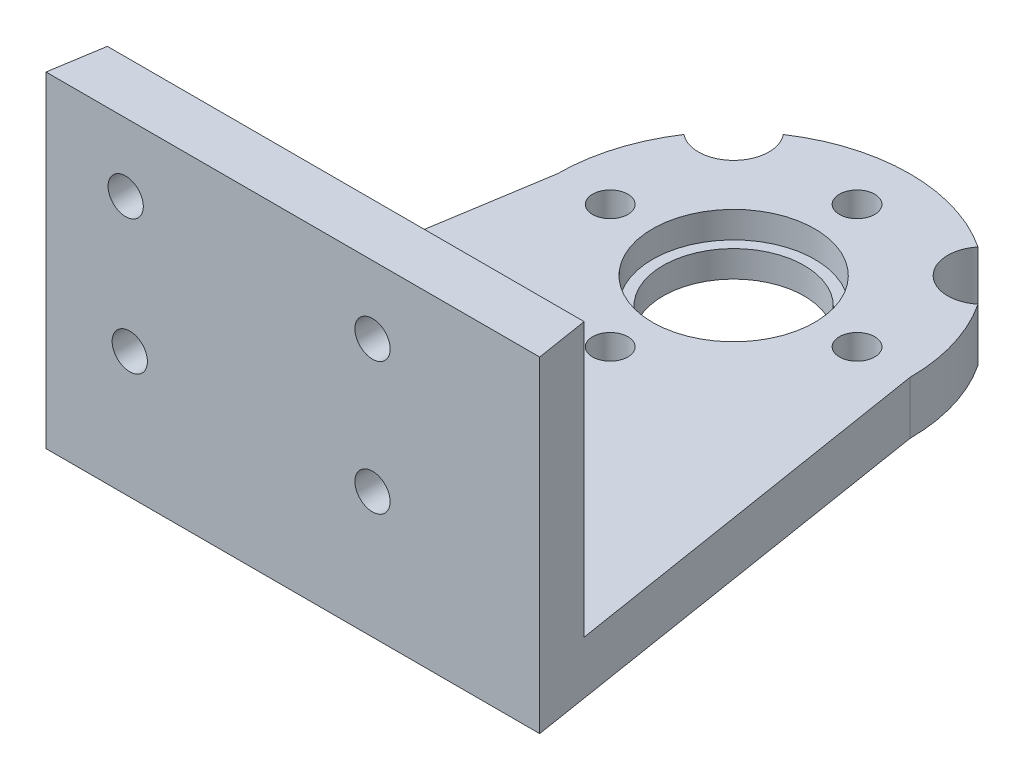
ISO-10303-21;
HEADER;
FILE_DESCRIPTION(('STEP AP214'),'2;1');
FILE_NAME('part.step','',(''),(''),'','','');
FILE_SCHEMA(('AUTOMOTIVE_DESIGN { 1 0 10303 214 1 1 1 1 }'));
ENDSEC;
DATA;
#1=APPLICATION_CONTEXT('core data for automotive mechanical design processes');
#2=APPLICATION_PROTOCOL_DEFINITION('international standard','automotive_design',2000,#1);
#3=PRODUCT_CONTEXT('',#1,'mechanical');
#4=PRODUCT('Part','Part','',(#3));
#5=PRODUCT_RELATED_PRODUCT_CATEGORY('part','',(#4));
#6=PRODUCT_DEFINITION_FORMATION('','',#4);
#7=PRODUCT_DEFINITION_CONTEXT('part definition',#1,'design');
#8=PRODUCT_DEFINITION('design','',#6,#7);
#9=PRODUCT_DEFINITION_SHAPE('','',#8);
#10=(LENGTH_UNIT() NAMED_UNIT(*) SI_UNIT(.MILLI.,.METRE.));
#11=(NAMED_UNIT(*) PLANE_ANGLE_UNIT() SI_UNIT($,.RADIAN.));
#12=(NAMED_UNIT(*) SI_UNIT($,.STERADIAN.) SOLID_ANGLE_UNIT());
#13=UNCERTAINTY_MEASURE_WITH_UNIT(LENGTH_MEASURE(1.E-05),#10,'distance_accuracy_value','');
#14=(GEOMETRIC_REPRESENTATION_CONTEXT(3) GLOBAL_UNCERTAINTY_ASSIGNED_CONTEXT((#13)) GLOBAL_UNIT_ASSIGNED_CONTEXT((#10,
#11,#12)) REPRESENTATION_CONTEXT('',''));
#15=CARTESIAN_POINT('',(0.,0.,0.));
#16=DIRECTION('',(0.,0.,1.));
#17=DIRECTION('',(1.,0.,0.));
#18=AXIS2_PLACEMENT_3D('',#15,#16,#17);
#19=CARTESIAN_POINT('',(-4.6552,1.5,-4.6552));
#20=DIRECTION('',(0.,1.,0.));
#21=DIRECTION('',(0.,0.,1.));
#22=AXIS2_PLACEMENT_3D('',#19,#20,#21);
#23=PLANE('',#22);
#24=CARTESIAN_POINT('',(0.,1.5,0.));
#25=DIRECTION('',(0.,1.,0.));
#26=DIRECTION('',(0.,0.,1.));
#27=AXIS2_PLACEMENT_3D('',#24,#25,#26);
#28=CIRCLE('',#27,4.);
#29=CARTESIAN_POINT('',(0.,1.5,4.));
#30=VERTEX_POINT('',#29);
#31=EDGE_CURVE('E21',#30,#30,#28,.T.);
#32=ORIENTED_EDGE('',*,*,#31,.F.);
#33=EDGE_LOOP('',(#32));
#34=FACE_BOUND('',#33,.T.);
#35=CARTESIAN_POINT('',(0.,1.5,0.));
#36=DIRECTION('',(0.,1.,0.));
#37=DIRECTION('',(0.,0.,1.));
#38=AXIS2_PLACEMENT_3D('',#35,#36,#37);
#39=CIRCLE('',#38,4.6);
#40=CARTESIAN_POINT('',(0.,1.5,4.6));
#41=VERTEX_POINT('',#40);
#42=EDGE_CURVE('E247',#41,#41,#39,.F.);
#43=ORIENTED_EDGE('',*,*,#42,.F.);
#44=EDGE_LOOP('',(#43));
#45=FACE_BOUND('',#44,.T.);
#46=ADVANCED_FACE('F17',(#34,#45),#23,.T.);
#47=CARTESIAN_POINT('',(0.,0.,0.));
#48=DIRECTION('',(0.,1.,0.));
#49=DIRECTION('',(0.,0.,1.));
#50=AXIS2_PLACEMENT_3D('',#47,#48,#49);
#51=CYLINDRICAL_SURFACE('',#50,4.);
#52=CARTESIAN_POINT('',(0.,0.,0.));
#53=DIRECTION('',(0.,1.,0.));
#54=DIRECTION('',(0.,0.,1.));
#55=AXIS2_PLACEMENT_3D('',#52,#53,#54);
#56=CIRCLE('',#55,4.);
#57=CARTESIAN_POINT('',(0.,0.,4.));
#58=VERTEX_POINT('',#57);
#59=EDGE_CURVE('E212',#58,#58,#56,.T.);
#60=ORIENTED_EDGE('',*,*,#59,.F.);
#61=EDGE_LOOP('',(#60));
#62=FACE_BOUND('',#61,.T.);
#63=ORIENTED_EDGE('',*,*,#31,.T.);
#64=EDGE_LOOP('',(#63));
#65=FACE_BOUND('',#64,.T.);
#66=ADVANCED_FACE('F520',(#62,#65),#51,.F.);
#67=CARTESIAN_POINT('',(0.,3.,0.));
#68=DIRECTION('',(0.,-1.,0.));
#69=DIRECTION('',(0.,0.,-1.));
#70=AXIS2_PLACEMENT_3D('',#67,#68,#69);
#71=CYLINDRICAL_SURFACE('',#70,10.);
#72=DIRECTION('',(0.,-1.,0.));
#73=VECTOR('',#72,1.);
#74=CARTESIAN_POINT('',(-8.33677118611014,1.5,-5.5225217238544));
#75=LINE('',#74,#73);
#76=CARTESIAN_POINT('',(-8.33677118483739,0.,-5.52252172577574));
#77=VERTEX_POINT('',#76);
#78=CARTESIAN_POINT('',(-8.33677118483739,3.,-5.52252172577574));
#79=VERTEX_POINT('',#78);
#80=EDGE_CURVE('E261',#77,#79,#75,.F.);
#81=ORIENTED_EDGE('',*,*,#80,.F.);
#82=CARTESIAN_POINT('',(0.,0.,0.));
#83=DIRECTION('',(0.,-1.,0.));
#84=DIRECTION('',(0.,0.,-1.));
#85=AXIS2_PLACEMENT_3D('',#82,#83,#84);
#86=CIRCLE('',#85,10.);
#87=CARTESIAN_POINT('',(-10.,0.,0.));
#88=VERTEX_POINT('',#87);
#89=EDGE_CURVE('E243',#88,#77,#86,.T.);
#90=ORIENTED_EDGE('',*,*,#89,.F.);
#91=DIRECTION('',(0.,1.,0.));
#92=VECTOR('',#91,1.);
#93=CARTESIAN_POINT('',(-10.,9.25,0.));
#94=LINE('',#93,#92);
#95=CARTESIAN_POINT('',(-10.,3.,0.));
#96=VERTEX_POINT('',#95);
#97=EDGE_CURVE('E115',#88,#96,#94,.T.);
#98=ORIENTED_EDGE('',*,*,#97,.T.);
#99=CARTESIAN_POINT('',(0.,3.,0.));
#100=DIRECTION('',(0.,-1.,0.));
#101=DIRECTION('',(0.,0.,-1.));
#102=AXIS2_PLACEMENT_3D('',#99,#100,#101);
#103=CIRCLE('',#102,10.);
#104=EDGE_CURVE('E204',#96,#79,#103,.T.);
#105=ORIENTED_EDGE('',*,*,#104,.T.);
#106=EDGE_LOOP('',(#81,#90,#98,#105));
#107=FACE_BOUND('',#106,.T.);
#108=ADVANCED_FACE('F278',(#107),#71,.T.);
#109=CARTESIAN_POINT('',(-7.071067812,0.,-7.071067812));
#110=DIRECTION('',(0.,1.,0.));
#111=DIRECTION('',(0.,0.,1.));
#112=AXIS2_PLACEMENT_3D('',#109,#110,#111);
#113=CYLINDRICAL_SURFACE('',#112,2.);
#114=CARTESIAN_POINT('',(-7.071067812,3.,-7.071067812));
#115=DIRECTION('',(0.,1.,0.));
#116=DIRECTION('',(0.,0.,1.));
#117=AXIS2_PLACEMENT_3D('',#114,#115,#116);
#118=CIRCLE('',#117,2.);
#119=CARTESIAN_POINT('',(-5.52252172812786,3.,-8.33677118327927));
#120=VERTEX_POINT('',#119);
#121=EDGE_CURVE('E84',#79,#120,#118,.T.);
#122=ORIENTED_EDGE('',*,*,#121,.T.);
#123=DIRECTION('',(0.,1.,0.));
#124=VECTOR('',#123,1.);
#125=CARTESIAN_POINT('',(-5.52252172855865,1.5,-8.3367711829939));
#126=LINE('',#125,#124);
#127=CARTESIAN_POINT('',(-5.52252172812786,0.,-8.33677118327927));
#128=VERTEX_POINT('',#127);
#129=EDGE_CURVE('E256',#120,#128,#126,.F.);
#130=ORIENTED_EDGE('',*,*,#129,.T.);
#131=CARTESIAN_POINT('',(-7.071067812,0.,-7.071067812));
#132=DIRECTION('',(0.,1.,0.));
#133=DIRECTION('',(0.,0.,1.));
#134=AXIS2_PLACEMENT_3D('',#131,#132,#133);
#135=CIRCLE('',#134,2.);
#136=EDGE_CURVE('E240',#77,#128,#135,.T.);
#137=ORIENTED_EDGE('',*,*,#136,.F.);
#138=ORIENTED_EDGE('',*,*,#80,.T.);
#139=EDGE_LOOP('',(#122,#130,#137,#138));
#140=FACE_BOUND('',#139,.T.);
#141=ADVANCED_FACE('F281',(#140),#113,.F.);
#142=CARTESIAN_POINT('',(0.,3.,0.));
#143=DIRECTION('',(0.,-1.,0.));
#144=DIRECTION('',(0.,0.,-1.));
#145=AXIS2_PLACEMENT_3D('',#142,#143,#144);
#146=CYLINDRICAL_SURFACE('',#145,10.);
#147=CARTESIAN_POINT('',(0.,3.,0.));
#148=DIRECTION('',(0.,-1.,0.));
#149=DIRECTION('',(0.,0.,-1.));
#150=AXIS2_PLACEMENT_3D('',#147,#148,#149);
#151=CIRCLE('',#150,10.);
#152=CARTESIAN_POINT('',(5.52252172785054,3.,-8.33677118375239));
#153=VERTEX_POINT('',#152);
#154=EDGE_CURVE('E88',#120,#153,#151,.T.);
#155=ORIENTED_EDGE('',*,*,#154,.T.);
#156=DIRECTION('',(0.,-1.,0.));
#157=VECTOR('',#156,1.);
#158=CARTESIAN_POINT('',(5.522521728004,1.5,-8.33677118394015));
#159=LINE('',#158,#157);
#160=CARTESIAN_POINT('',(5.52252172785054,0.,-8.33677118375239));
#161=VERTEX_POINT('',#160);
#162=EDGE_CURVE('E94',#161,#153,#159,.F.);
#163=ORIENTED_EDGE('',*,*,#162,.F.);
#164=CARTESIAN_POINT('',(0.,0.,0.));
#165=DIRECTION('',(0.,-1.,0.));
#166=DIRECTION('',(0.,0.,-1.));
#167=AXIS2_PLACEMENT_3D('',#164,#165,#166);
#168=CIRCLE('',#167,10.);
#169=EDGE_CURVE('E238',#128,#161,#168,.T.);
#170=ORIENTED_EDGE('',*,*,#169,.F.);
#171=ORIENTED_EDGE('',*,*,#129,.F.);
#172=EDGE_LOOP('',(#155,#163,#170,#171));
#173=FACE_BOUND('',#172,.T.);
#174=ADVANCED_FACE('F283',(#173),#146,.T.);
#175=CARTESIAN_POINT('',(7.071067812,0.,-7.071067812));
#176=DIRECTION('',(0.,1.,0.));
#177=DIRECTION('',(0.,0.,1.));
#178=AXIS2_PLACEMENT_3D('',#175,#176,#177);
#179=CYLINDRICAL_SURFACE('',#178,2.);
#180=ORIENTED_EDGE('',*,*,#162,.T.);
#181=CARTESIAN_POINT('',(7.071067812,3.,-7.071067812));
#182=DIRECTION('',(0.,1.,0.));
#183=DIRECTION('',(0.,0.,1.));
#184=AXIS2_PLACEMENT_3D('',#181,#182,#183);
#185=CIRCLE('',#184,2.);
#186=CARTESIAN_POINT('',(8.3367711843415,3.,-5.52252172652433));
#187=VERTEX_POINT('',#186);
#188=EDGE_CURVE('E200',#153,#187,#185,.T.);
#189=ORIENTED_EDGE('',*,*,#188,.T.);
#190=DIRECTION('',(0.,1.,0.));
#191=VECTOR('',#190,1.);
#192=CARTESIAN_POINT('',(8.33677118511837,1.5,-5.52252172535157));
#193=LINE('',#192,#191);
#194=CARTESIAN_POINT('',(8.3367711843415,0.,-5.52252172652433));
#195=VERTEX_POINT('',#194);
#196=EDGE_CURVE('E249',#187,#195,#193,.F.);
#197=ORIENTED_EDGE('',*,*,#196,.T.);
#198=CARTESIAN_POINT('',(7.071067812,0.,-7.071067812));
#199=DIRECTION('',(0.,1.,0.));
#200=DIRECTION('',(0.,0.,1.));
#201=AXIS2_PLACEMENT_3D('',#198,#199,#200);
#202=CIRCLE('',#201,2.);
#203=EDGE_CURVE('E236',#161,#195,#202,.T.);
#204=ORIENTED_EDGE('',*,*,#203,.F.);
#205=EDGE_LOOP('',(#180,#189,#197,#204));
#206=FACE_BOUND('',#205,.T.);
#207=ADVANCED_FACE('F284',(#206),#179,.F.);
#208=CARTESIAN_POINT('',(0.,3.,0.));
#209=DIRECTION('',(0.,-1.,0.));
#210=DIRECTION('',(0.,0.,-1.));
#211=AXIS2_PLACEMENT_3D('',#208,#209,#210);
#212=CYLINDRICAL_SURFACE('',#211,10.);
#213=ORIENTED_EDGE('',*,*,#196,.F.);
#214=CARTESIAN_POINT('',(0.,3.,0.));
#215=DIRECTION('',(0.,-1.,0.));
#216=DIRECTION('',(0.,0.,-1.));
#217=AXIS2_PLACEMENT_3D('',#214,#215,#216);
#218=CIRCLE('',#217,10.);
#219=CARTESIAN_POINT('',(10.,3.,0.));
#220=VERTEX_POINT('',#219);
#221=EDGE_CURVE('E197',#187,#220,#218,.T.);
#222=ORIENTED_EDGE('',*,*,#221,.T.);
#223=DIRECTION('',(0.,-1.,0.));
#224=VECTOR('',#223,1.);
#225=CARTESIAN_POINT('',(10.,9.25,0.));
#226=LINE('',#225,#224);
#227=CARTESIAN_POINT('',(10.,0.,0.));
#228=VERTEX_POINT('',#227);
#229=EDGE_CURVE('E148',#220,#228,#226,.T.);
#230=ORIENTED_EDGE('',*,*,#229,.T.);
#231=CARTESIAN_POINT('',(0.,0.,0.));
#232=DIRECTION('',(0.,-1.,0.));
#233=DIRECTION('',(0.,0.,-1.));
#234=AXIS2_PLACEMENT_3D('',#231,#232,#233);
#235=CIRCLE('',#234,10.);
#236=EDGE_CURVE('E246',#195,#228,#235,.T.);
#237=ORIENTED_EDGE('',*,*,#236,.F.);
#238=EDGE_LOOP('',(#213,#222,#230,#237));
#239=FACE_BOUND('',#238,.T.);
#240=ADVANCED_FACE('F286',(#239),#212,.T.);
#241=CARTESIAN_POINT('',(0.,1.5,0.));
#242=DIRECTION('',(0.,1.,0.));
#243=DIRECTION('',(0.,0.,1.));
#244=AXIS2_PLACEMENT_3D('',#241,#242,#243);
#245=CYLINDRICAL_SURFACE('',#244,4.6);
#246=ORIENTED_EDGE('',*,*,#42,.T.);
#247=EDGE_LOOP('',(#246));
#248=FACE_BOUND('',#247,.T.);
#249=CARTESIAN_POINT('',(0.,3.,0.));
#250=DIRECTION('',(0.,1.,0.));
#251=DIRECTION('',(0.,0.,1.));
#252=AXIS2_PLACEMENT_3D('',#249,#250,#251);
#253=CIRCLE('',#252,4.6);
#254=CARTESIAN_POINT('',(0.,3.,4.6));
#255=VERTEX_POINT('',#254);
#256=EDGE_CURVE('E194',#255,#255,#253,.T.);
#257=ORIENTED_EDGE('',*,*,#256,.T.);
#258=EDGE_LOOP('',(#257));
#259=FACE_BOUND('',#258,.T.);
#260=ADVANCED_FACE('F293',(#248,#259),#245,.F.);
#261=CARTESIAN_POINT('',(-6.52,0.,19.));
#262=DIRECTION('',(0.,1.,0.));
#263=DIRECTION('',(0.,0.,1.));
#264=AXIS2_PLACEMENT_3D('',#261,#262,#263);
#265=CYLINDRICAL_SURFACE('',#264,1.);
#266=CARTESIAN_POINT('',(-6.52,0.,19.));
#267=DIRECTION('',(0.,1.,0.));
#268=DIRECTION('',(0.,0.,1.));
#269=AXIS2_PLACEMENT_3D('',#266,#267,#268);
#270=CIRCLE('',#269,1.);
#271=CARTESIAN_POINT('',(-6.52,0.,20.));
#272=VERTEX_POINT('',#271);
#273=EDGE_CURVE('E215',#272,#272,#270,.T.);
#274=ORIENTED_EDGE('',*,*,#273,.F.);
#275=EDGE_LOOP('',(#274));
#276=FACE_BOUND('',#275,.T.);
#277=CARTESIAN_POINT('',(-6.52,3.,19.));
#278=DIRECTION('',(0.,1.,0.));
#279=DIRECTION('',(0.,0.,1.));
#280=AXIS2_PLACEMENT_3D('',#277,#278,#279);
#281=CIRCLE('',#280,1.);
#282=CARTESIAN_POINT('',(-6.52,3.,20.));
#283=VERTEX_POINT('',#282);
#284=EDGE_CURVE('E191',#283,#283,#281,.T.);
#285=ORIENTED_EDGE('',*,*,#284,.T.);
#286=EDGE_LOOP('',(#285));
#287=FACE_BOUND('',#286,.T.);
#288=ADVANCED_FACE('F343',(#276,#287),#265,.F.);
#289=CARTESIAN_POINT('',(6.52,0.,19.));
#290=DIRECTION('',(0.,1.,0.));
#291=DIRECTION('',(0.,0.,1.));
#292=AXIS2_PLACEMENT_3D('',#289,#290,#291);
#293=CYLINDRICAL_SURFACE('',#292,1.);
#294=CARTESIAN_POINT('',(6.52,0.,19.));
#295=DIRECTION('',(0.,1.,0.));
#296=DIRECTION('',(0.,0.,1.));
#297=AXIS2_PLACEMENT_3D('',#294,#295,#296);
#298=CIRCLE('',#297,1.);
#299=CARTESIAN_POINT('',(6.52,0.,20.));
#300=VERTEX_POINT('',#299);
#301=EDGE_CURVE('E218',#300,#300,#298,.T.);
#302=ORIENTED_EDGE('',*,*,#301,.F.);
#303=EDGE_LOOP('',(#302));
#304=FACE_BOUND('',#303,.T.);
#305=CARTESIAN_POINT('',(6.52,3.,19.));
#306=DIRECTION('',(0.,1.,0.));
#307=DIRECTION('',(0.,0.,1.));
#308=AXIS2_PLACEMENT_3D('',#305,#306,#307);
#309=CIRCLE('',#308,1.);
#310=CARTESIAN_POINT('',(6.52,3.,20.));
#311=VERTEX_POINT('',#310);
#312=EDGE_CURVE('E188',#311,#311,#309,.T.);
#313=ORIENTED_EDGE('',*,*,#312,.T.);
#314=EDGE_LOOP('',(#313));
#315=FACE_BOUND('',#314,.T.);
#316=ADVANCED_FACE('F339',(#304,#315),#293,.F.);
#317=CARTESIAN_POINT('',(0.,0.,19.));
#318=DIRECTION('',(0.,1.,0.));
#319=DIRECTION('',(0.,0.,1.));
#320=AXIS2_PLACEMENT_3D('',#317,#318,#319);
#321=CYLINDRICAL_SURFACE('',#320,1.);
#322=CARTESIAN_POINT('',(0.,0.,19.));
#323=DIRECTION('',(0.,1.,0.));
#324=DIRECTION('',(0.,0.,1.));
#325=AXIS2_PLACEMENT_3D('',#322,#323,#324);
#326=CIRCLE('',#325,1.);
#327=CARTESIAN_POINT('',(0.,0.,20.));
#328=VERTEX_POINT('',#327);
#329=EDGE_CURVE('E221',#328,#328,#326,.T.);
#330=ORIENTED_EDGE('',*,*,#329,.F.);
#331=EDGE_LOOP('',(#330));
#332=FACE_BOUND('',#331,.T.);
#333=CARTESIAN_POINT('',(0.,3.,19.));
#334=DIRECTION('',(0.,1.,0.));
#335=DIRECTION('',(0.,0.,1.));
#336=AXIS2_PLACEMENT_3D('',#333,#334,#335);
#337=CIRCLE('',#336,1.);
#338=CARTESIAN_POINT('',(0.,3.,20.));
#339=VERTEX_POINT('',#338);
#340=EDGE_CURVE('E185',#339,#339,#337,.T.);
#341=ORIENTED_EDGE('',*,*,#340,.T.);
#342=EDGE_LOOP('',(#341));
#343=FACE_BOUND('',#342,.T.);
#344=ADVANCED_FACE('F335',(#332,#343),#321,.F.);
#345=CARTESIAN_POINT('',(0.,0.,7.));
#346=DIRECTION('',(0.,1.,0.));
#347=DIRECTION('',(0.,0.,1.));
#348=AXIS2_PLACEMENT_3D('',#345,#346,#347);
#349=CYLINDRICAL_SURFACE('',#348,1.);
#350=CARTESIAN_POINT('',(0.,0.,7.));
#351=DIRECTION('',(0.,1.,0.));
#352=DIRECTION('',(0.,0.,1.));
#353=AXIS2_PLACEMENT_3D('',#350,#351,#352);
#354=CIRCLE('',#353,1.);
#355=CARTESIAN_POINT('',(0.,0.,8.));
#356=VERTEX_POINT('',#355);
#357=EDGE_CURVE('E224',#356,#356,#354,.T.);
#358=ORIENTED_EDGE('',*,*,#357,.F.);
#359=EDGE_LOOP('',(#358));
#360=FACE_BOUND('',#359,.T.);
#361=CARTESIAN_POINT('',(0.,3.,7.));
#362=DIRECTION('',(0.,1.,0.));
#363=DIRECTION('',(0.,0.,1.));
#364=AXIS2_PLACEMENT_3D('',#361,#362,#363);
#365=CIRCLE('',#364,1.);
#366=CARTESIAN_POINT('',(0.,3.,8.));
#367=VERTEX_POINT('',#366);
#368=EDGE_CURVE('E182',#367,#367,#365,.T.);
#369=ORIENTED_EDGE('',*,*,#368,.T.);
#370=EDGE_LOOP('',(#369));
#371=FACE_BOUND('',#370,.T.);
#372=ADVANCED_FACE('F331',(#360,#371),#349,.F.);
#373=CARTESIAN_POINT('',(-7.,0.,0.));
#374=DIRECTION('',(0.,1.,0.));
#375=DIRECTION('',(0.,0.,1.));
#376=AXIS2_PLACEMENT_3D('',#373,#374,#375);
#377=CYLINDRICAL_SURFACE('',#376,1.);
#378=CARTESIAN_POINT('',(-7.,0.,0.));
#379=DIRECTION('',(0.,1.,0.));
#380=DIRECTION('',(0.,0.,1.));
#381=AXIS2_PLACEMENT_3D('',#378,#379,#380);
#382=CIRCLE('',#381,1.);
#383=CARTESIAN_POINT('',(-7.,0.,1.));
#384=VERTEX_POINT('',#383);
#385=EDGE_CURVE('E227',#384,#384,#382,.T.);
#386=ORIENTED_EDGE('',*,*,#385,.F.);
#387=EDGE_LOOP('',(#386));
#388=FACE_BOUND('',#387,.T.);
#389=CARTESIAN_POINT('',(-7.,3.,0.));
#390=DIRECTION('',(0.,1.,0.));
#391=DIRECTION('',(0.,0.,1.));
#392=AXIS2_PLACEMENT_3D('',#389,#390,#391);
#393=CIRCLE('',#392,1.);
#394=CARTESIAN_POINT('',(-7.,3.,1.));
#395=VERTEX_POINT('',#394);
#396=EDGE_CURVE('E179',#395,#395,#393,.T.);
#397=ORIENTED_EDGE('',*,*,#396,.T.);
#398=EDGE_LOOP('',(#397));
#399=FACE_BOUND('',#398,.T.);
#400=ADVANCED_FACE('F327',(#388,#399),#377,.F.);
#401=CARTESIAN_POINT('',(0.,0.,-7.));
#402=DIRECTION('',(0.,1.,0.));
#403=DIRECTION('',(0.,0.,1.));
#404=AXIS2_PLACEMENT_3D('',#401,#402,#403);
#405=CYLINDRICAL_SURFACE('',#404,1.);
#406=CARTESIAN_POINT('',(0.,0.,-7.));
#407=DIRECTION('',(0.,1.,0.));
#408=DIRECTION('',(0.,0.,1.));
#409=AXIS2_PLACEMENT_3D('',#406,#407,#408);
#410=CIRCLE('',#409,1.);
#411=CARTESIAN_POINT('',(0.,0.,-6.));
#412=VERTEX_POINT('',#411);
#413=EDGE_CURVE('E230',#412,#412,#410,.T.);
#414=ORIENTED_EDGE('',*,*,#413,.F.);
#415=EDGE_LOOP('',(#414));
#416=FACE_BOUND('',#415,.T.);
#417=CARTESIAN_POINT('',(0.,3.,-7.));
#418=DIRECTION('',(0.,1.,0.));
#419=DIRECTION('',(0.,0.,1.));
#420=AXIS2_PLACEMENT_3D('',#417,#418,#419);
#421=CIRCLE('',#420,1.);
#422=CARTESIAN_POINT('',(0.,3.,-6.));
#423=VERTEX_POINT('',#422);
#424=EDGE_CURVE('E132',#423,#423,#421,.T.);
#425=ORIENTED_EDGE('',*,*,#424,.T.);
#426=EDGE_LOOP('',(#425));
#427=FACE_BOUND('',#426,.T.);
#428=ADVANCED_FACE('F323',(#416,#427),#405,.F.);
#429=CARTESIAN_POINT('',(7.,0.,0.));
#430=DIRECTION('',(0.,1.,0.));
#431=DIRECTION('',(0.,0.,1.));
#432=AXIS2_PLACEMENT_3D('',#429,#430,#431);
#433=CYLINDRICAL_SURFACE('',#432,1.);
#434=CARTESIAN_POINT('',(7.,0.,0.));
#435=DIRECTION('',(0.,1.,0.));
#436=DIRECTION('',(0.,0.,1.));
#437=AXIS2_PLACEMENT_3D('',#434,#435,#436);
#438=CIRCLE('',#437,1.);
#439=CARTESIAN_POINT('',(7.,0.,1.));
#440=VERTEX_POINT('',#439);
#441=EDGE_CURVE('E233',#440,#440,#438,.T.);
#442=ORIENTED_EDGE('',*,*,#441,.F.);
#443=EDGE_LOOP('',(#442));
#444=FACE_BOUND('',#443,.T.);
#445=CARTESIAN_POINT('',(7.,3.,0.));
#446=DIRECTION('',(0.,1.,0.));
#447=DIRECTION('',(0.,0.,1.));
#448=AXIS2_PLACEMENT_3D('',#445,#446,#447);
#449=CIRCLE('',#448,1.);
#450=CARTESIAN_POINT('',(7.,3.,1.));
#451=VERTEX_POINT('',#450);
#452=EDGE_CURVE('E129',#451,#451,#449,.T.);
#453=ORIENTED_EDGE('',*,*,#452,.T.);
#454=EDGE_LOOP('',(#453));
#455=FACE_BOUND('',#454,.T.);
#456=ADVANCED_FACE('F320',(#444,#455),#433,.F.);
#457=CARTESIAN_POINT('',(-14.168,0.,25.));
#458=DIRECTION('',(0.,-1.,0.));
#459=DIRECTION('',(0.,0.,-1.));
#460=AXIS2_PLACEMENT_3D('',#457,#458,#459);
#461=PLANE('',#460);
#462=ORIENTED_EDGE('',*,*,#59,.T.);
#463=EDGE_LOOP('',(#462));
#464=FACE_BOUND('',#463,.T.);
#465=ORIENTED_EDGE('',*,*,#273,.T.);
#466=EDGE_LOOP('',(#465));
#467=FACE_BOUND('',#466,.T.);
#468=ORIENTED_EDGE('',*,*,#301,.T.);
#469=EDGE_LOOP('',(#468));
#470=FACE_BOUND('',#469,.T.);
#471=ORIENTED_EDGE('',*,*,#329,.T.);
#472=EDGE_LOOP('',(#471));
#473=FACE_BOUND('',#472,.T.);
#474=ORIENTED_EDGE('',*,*,#357,.T.);
#475=EDGE_LOOP('',(#474));
#476=FACE_BOUND('',#475,.T.);
#477=ORIENTED_EDGE('',*,*,#385,.T.);
#478=EDGE_LOOP('',(#477));
#479=FACE_BOUND('',#478,.T.);
#480=ORIENTED_EDGE('',*,*,#413,.T.);
#481=EDGE_LOOP('',(#480));
#482=FACE_BOUND('',#481,.T.);
#483=ORIENTED_EDGE('',*,*,#441,.T.);
#484=EDGE_LOOP('',(#483));
#485=FACE_BOUND('',#484,.T.);
#486=ORIENTED_EDGE('',*,*,#169,.T.);
#487=ORIENTED_EDGE('',*,*,#203,.T.);
#488=ORIENTED_EDGE('',*,*,#236,.T.);
#489=DIRECTION('',(0.157990501106673,0.,0.987440631916705));
#490=VECTOR('',#489,1.);
#491=CARTESIAN_POINT('',(12.,0.,12.5));
#492=LINE('',#491,#490);
#493=CARTESIAN_POINT('',(13.9999999991103,0.,24.9999999998646));
#494=VERTEX_POINT('',#493);
#495=EDGE_CURVE('E145',#228,#494,#492,.T.);
#496=ORIENTED_EDGE('',*,*,#495,.T.);
#497=DIRECTION('',(-1.,0.,0.));
#498=VECTOR('',#497,1.);
#499=CARTESIAN_POINT('',(0.,0.,25.));
#500=LINE('',#499,#498);
#501=CARTESIAN_POINT('',(-13.9999999999567,0.,24.9999999997292));
#502=VERTEX_POINT('',#501);
#503=EDGE_CURVE('E140',#494,#502,#500,.T.);
#504=ORIENTED_EDGE('',*,*,#503,.T.);
#505=DIRECTION('',(0.157990501106673,0.,-0.987440631916705));
#506=VECTOR('',#505,1.);
#507=CARTESIAN_POINT('',(-12.,0.,12.5));
#508=LINE('',#507,#506);
#509=EDGE_CURVE('E114',#502,#88,#508,.T.);
#510=ORIENTED_EDGE('',*,*,#509,.T.);
#511=ORIENTED_EDGE('',*,*,#89,.T.);
#512=ORIENTED_EDGE('',*,*,#136,.T.);
#513=EDGE_LOOP('',(#486,#487,#488,#496,#504,#510,#511,#512));
#514=FACE_BOUND('',#513,.T.);
#515=ADVANCED_FACE('F270',(#464,#467,#470,#473,#476,#479,#482,#485,#514),#461,.T.);
#516=CARTESIAN_POINT('',(10.,0.,0.));
#517=DIRECTION('',(-0.987440631916705,0.,0.157990501106673));
#518=DIRECTION('',(0.157990501106673,0.,0.987440631916705));
#519=AXIS2_PLACEMENT_3D('',#516,#517,#518);
#520=PLANE('',#519);
#521=ORIENTED_EDGE('',*,*,#229,.F.);
#522=DIRECTION('',(0.157990501106673,0.,0.987440631916705));
#523=VECTOR('',#522,1.);
#524=CARTESIAN_POINT('',(10.,3.,0.));
#525=LINE('',#524,#523);
#526=CARTESIAN_POINT('',(13.52,3.,22.));
#527=VERTEX_POINT('',#526);
#528=EDGE_CURVE('E208',#220,#527,#525,.T.);
#529=ORIENTED_EDGE('',*,*,#528,.T.);
#530=DIRECTION('',(0.,1.,0.));
#531=VECTOR('',#530,1.);
#532=CARTESIAN_POINT('',(13.52,10.75,22.));
#533=LINE('',#532,#531);
#534=CARTESIAN_POINT('',(13.519999998752,18.5,22.));
#535=VERTEX_POINT('',#534);
#536=EDGE_CURVE('E155',#527,#535,#533,.T.);
#537=ORIENTED_EDGE('',*,*,#536,.T.);
#538=DIRECTION('',(-0.157990499679173,0.,-0.987440632145105));
#539=VECTOR('',#538,1.);
#540=CARTESIAN_POINT('',(13.999999993056,18.5,25.));
#541=LINE('',#540,#539);
#542=CARTESIAN_POINT('',(13.999999996528,18.5,25.));
#543=VERTEX_POINT('',#542);
#544=EDGE_CURVE('E147',#543,#535,#541,.T.);
#545=ORIENTED_EDGE('',*,*,#544,.F.);
#546=DIRECTION('',(0.,-1.,0.));
#547=VECTOR('',#546,1.);
#548=CARTESIAN_POINT('',(14.,9.25,25.));
#549=LINE('',#548,#547);
#550=EDGE_CURVE('E125',#543,#494,#549,.T.);
#551=ORIENTED_EDGE('',*,*,#550,.T.);
#552=ORIENTED_EDGE('',*,*,#495,.F.);
#553=EDGE_LOOP('',(#521,#529,#537,#545,#551,#552));
#554=FACE_BOUND('',#553,.T.);
#555=ADVANCED_FACE('F274',(#554),#520,.F.);
#556=CARTESIAN_POINT('',(-14.168,18.5,22.));
#557=DIRECTION('',(0.,1.,0.));
#558=DIRECTION('',(0.,0.,1.));
#559=AXIS2_PLACEMENT_3D('',#556,#557,#558);
#560=PLANE('',#559);
#561=ORIENTED_EDGE('',*,*,#544,.T.);
#562=DIRECTION('',(-1.,0.,0.));
#563=VECTOR('',#562,1.);
#564=CARTESIAN_POINT('',(0.,18.5,22.));
#565=LINE('',#564,#563);
#566=CARTESIAN_POINT('',(-13.519999998752,18.5,22.));
#567=VERTEX_POINT('',#566);
#568=EDGE_CURVE('E109',#535,#567,#565,.T.);
#569=ORIENTED_EDGE('',*,*,#568,.T.);
#570=DIRECTION('',(-0.157990501106673,0.,0.987440631916705));
#571=VECTOR('',#570,1.);
#572=CARTESIAN_POINT('',(-12.,18.5,12.5));
#573=LINE('',#572,#571);
#574=CARTESIAN_POINT('',(-13.999999998264,18.5,25.));
#575=VERTEX_POINT('',#574);
#576=EDGE_CURVE('E104',#567,#575,#573,.T.);
#577=ORIENTED_EDGE('',*,*,#576,.T.);
#578=DIRECTION('',(1.,0.,0.));
#579=VECTOR('',#578,1.);
#580=CARTESIAN_POINT('',(0.,18.5,25.));
#581=LINE('',#580,#579);
#582=EDGE_CURVE('E107',#575,#543,#581,.T.);
#583=ORIENTED_EDGE('',*,*,#582,.T.);
#584=EDGE_LOOP('',(#561,#569,#577,#583));
#585=FACE_BOUND('',#584,.T.);
#586=ADVANCED_FACE('F106',(#585),#560,.T.);
#587=CARTESIAN_POINT('',(-14.,0.,25.));
#588=DIRECTION('',(0.987440631916705,0.,0.157990501106673));
#589=DIRECTION('',(0.157990501106673,0.,-0.987440631916705));
#590=AXIS2_PLACEMENT_3D('',#587,#588,#589);
#591=PLANE('',#590);
#592=DIRECTION('',(0.,1.,0.));
#593=VECTOR('',#592,1.);
#594=CARTESIAN_POINT('',(-14.,9.25,25.));
#595=LINE('',#594,#593);
#596=EDGE_CURVE('E122',#502,#575,#595,.T.);
#597=ORIENTED_EDGE('',*,*,#596,.T.);
#598=ORIENTED_EDGE('',*,*,#576,.F.);
#599=DIRECTION('',(0.,-1.,0.));
#600=VECTOR('',#599,1.);
#601=CARTESIAN_POINT('',(-13.52,10.75,22.));
#602=LINE('',#601,#600);
#603=CARTESIAN_POINT('',(-13.52,3.,22.));
#604=VERTEX_POINT('',#603);
#605=EDGE_CURVE('E154',#567,#604,#602,.T.);
#606=ORIENTED_EDGE('',*,*,#605,.T.);
#607=DIRECTION('',(0.157990501106673,0.,-0.987440631916705));
#608=VECTOR('',#607,1.);
#609=CARTESIAN_POINT('',(-14.,3.,25.));
#610=LINE('',#609,#608);
#611=EDGE_CURVE('E36',#604,#96,#610,.T.);
#612=ORIENTED_EDGE('',*,*,#611,.T.);
#613=ORIENTED_EDGE('',*,*,#97,.F.);
#614=ORIENTED_EDGE('',*,*,#509,.F.);
#615=EDGE_LOOP('',(#597,#598,#606,#612,#613,#614));
#616=FACE_BOUND('',#615,.T.);
#617=ADVANCED_FACE('F127',(#616),#591,.F.);
#618=CARTESIAN_POINT('',(-13.68224,3.,22.));
#619=DIRECTION('',(0.,-1.,0.));
#620=DIRECTION('',(0.,0.,-1.));
#621=AXIS2_PLACEMENT_3D('',#618,#619,#620);
#622=PLANE('',#621);
#623=ORIENTED_EDGE('',*,*,#452,.F.);
#624=EDGE_LOOP('',(#623));
#625=FACE_BOUND('',#624,.T.);
#626=ORIENTED_EDGE('',*,*,#424,.F.);
#627=EDGE_LOOP('',(#626));
#628=FACE_BOUND('',#627,.T.);
#629=ORIENTED_EDGE('',*,*,#396,.F.);
#630=EDGE_LOOP('',(#629));
#631=FACE_BOUND('',#630,.T.);
#632=ORIENTED_EDGE('',*,*,#368,.F.);
#633=EDGE_LOOP('',(#632));
#634=FACE_BOUND('',#633,.T.);
#635=ORIENTED_EDGE('',*,*,#340,.F.);
#636=EDGE_LOOP('',(#635));
#637=FACE_BOUND('',#636,.T.);
#638=ORIENTED_EDGE('',*,*,#312,.F.);
#639=EDGE_LOOP('',(#638));
#640=FACE_BOUND('',#639,.T.);
#641=ORIENTED_EDGE('',*,*,#284,.F.);
#642=EDGE_LOOP('',(#641));
#643=FACE_BOUND('',#642,.T.);
#644=ORIENTED_EDGE('',*,*,#256,.F.);
#645=EDGE_LOOP('',(#644));
#646=FACE_BOUND('',#645,.T.);
#647=ORIENTED_EDGE('',*,*,#221,.F.);
#648=ORIENTED_EDGE('',*,*,#188,.F.);
#649=ORIENTED_EDGE('',*,*,#154,.F.);
#650=ORIENTED_EDGE('',*,*,#121,.F.);
#651=ORIENTED_EDGE('',*,*,#104,.F.);
#652=ORIENTED_EDGE('',*,*,#611,.F.);
#653=DIRECTION('',(1.,0.,0.));
#654=VECTOR('',#653,1.);
#655=CARTESIAN_POINT('',(0.,3.,22.));
#656=LINE('',#655,#654);
#657=EDGE_CURVE('E168',#604,#527,#656,.T.);
#658=ORIENTED_EDGE('',*,*,#657,.T.);
#659=ORIENTED_EDGE('',*,*,#528,.F.);
#660=EDGE_LOOP('',(#647,#648,#649,#650,#651,#652,#658,#659));
#661=FACE_BOUND('',#660,.T.);
#662=ADVANCED_FACE('F318',(#625,#628,#631,#634,#637,#640,#643,#646,#661),#622,.F.);
#663=CARTESIAN_POINT('',(-9.481224865,14.651837118,25.));
#664=DIRECTION('',(0.,0.,-1.));
#665=DIRECTION('',(-1.,0.,0.));
#666=AXIS2_PLACEMENT_3D('',#663,#664,#665);
#667=CYLINDRICAL_SURFACE('',#666,0.999999999999999);
#668=CARTESIAN_POINT('',(-9.481224865,14.651837118,25.));
#669=DIRECTION('',(0.,0.,-1.));
#670=DIRECTION('',(-1.,0.,0.));
#671=AXIS2_PLACEMENT_3D('',#668,#669,#670);
#672=CIRCLE('',#671,0.999999999999999);
#673=CARTESIAN_POINT('',(-10.481224865,14.651837118,25.));
#674=VERTEX_POINT('',#673);
#675=EDGE_CURVE('E142',#674,#674,#672,.F.);
#676=ORIENTED_EDGE('',*,*,#675,.T.);
#677=EDGE_LOOP('',(#676));
#678=FACE_BOUND('',#677,.T.);
#679=CARTESIAN_POINT('',(-9.481224865,14.651837118,22.));
#680=DIRECTION('',(0.,0.,-1.));
#681=DIRECTION('',(-1.,0.,0.));
#682=AXIS2_PLACEMENT_3D('',#679,#680,#681);
#683=CIRCLE('',#682,0.999999999999999);
#684=CARTESIAN_POINT('',(-10.481224865,14.651837118,22.));
#685=VERTEX_POINT('',#684);
#686=EDGE_CURVE('E165',#685,#685,#683,.T.);
#687=ORIENTED_EDGE('',*,*,#686,.T.);
#688=EDGE_LOOP('',(#687));
#689=FACE_BOUND('',#688,.T.);
#690=ADVANCED_FACE('F314',(#678,#689),#667,.F.);
#691=CARTESIAN_POINT('',(4.518775135,14.651837118,25.));
#692=DIRECTION('',(0.,0.,-1.));
#693=DIRECTION('',(-1.,0.,0.));
#694=AXIS2_PLACEMENT_3D('',#691,#692,#693);
#695=CYLINDRICAL_SURFACE('',#694,1.);
#696=CARTESIAN_POINT('',(4.518775135,14.651837118,25.));
#697=DIRECTION('',(0.,0.,-1.));
#698=DIRECTION('',(-1.,0.,0.));
#699=AXIS2_PLACEMENT_3D('',#696,#697,#698);
#700=CIRCLE('',#699,1.);
#701=CARTESIAN_POINT('',(3.518775135,14.651837118,25.));
#702=VERTEX_POINT('',#701);
#703=EDGE_CURVE('E172',#702,#702,#700,.F.);
#704=ORIENTED_EDGE('',*,*,#703,.T.);
#705=EDGE_LOOP('',(#704));
#706=FACE_BOUND('',#705,.T.);
#707=CARTESIAN_POINT('',(4.518775135,14.651837118,22.));
#708=DIRECTION('',(0.,0.,-1.));
#709=DIRECTION('',(-1.,0.,0.));
#710=AXIS2_PLACEMENT_3D('',#707,#708,#709);
#711=CIRCLE('',#710,1.);
#712=CARTESIAN_POINT('',(3.518775135,14.651837118,22.));
#713=VERTEX_POINT('',#712);
#714=EDGE_CURVE('E162',#713,#713,#711,.T.);
#715=ORIENTED_EDGE('',*,*,#714,.T.);
#716=EDGE_LOOP('',(#715));
#717=FACE_BOUND('',#716,.T.);
#718=ADVANCED_FACE('F310',(#706,#717),#695,.F.);
#719=CARTESIAN_POINT('',(4.518775135,7.151837118,25.));
#720=DIRECTION('',(0.,0.,-1.));
#721=DIRECTION('',(-1.,0.,0.));
#722=AXIS2_PLACEMENT_3D('',#719,#720,#721);
#723=CYLINDRICAL_SURFACE('',#722,1.);
#724=CARTESIAN_POINT('',(4.518775135,7.151837118,25.));
#725=DIRECTION('',(0.,0.,-1.));
#726=DIRECTION('',(-1.,0.,0.));
#727=AXIS2_PLACEMENT_3D('',#724,#725,#726);
#728=CIRCLE('',#727,1.);
#729=CARTESIAN_POINT('',(3.518775135,7.151837118,25.));
#730=VERTEX_POINT('',#729);
#731=EDGE_CURVE('E169',#730,#730,#728,.F.);
#732=ORIENTED_EDGE('',*,*,#731,.T.);
#733=EDGE_LOOP('',(#732));
#734=FACE_BOUND('',#733,.T.);
#735=CARTESIAN_POINT('',(4.518775135,7.151837118,22.));
#736=DIRECTION('',(0.,0.,-1.));
#737=DIRECTION('',(-1.,0.,0.));
#738=AXIS2_PLACEMENT_3D('',#735,#736,#737);
#739=CIRCLE('',#738,1.);
#740=CARTESIAN_POINT('',(3.518775135,7.151837118,22.));
#741=VERTEX_POINT('',#740);
#742=EDGE_CURVE('E159',#741,#741,#739,.T.);
#743=ORIENTED_EDGE('',*,*,#742,.T.);
#744=EDGE_LOOP('',(#743));
#745=FACE_BOUND('',#744,.T.);
#746=ADVANCED_FACE('F307',(#734,#745),#723,.F.);
#747=CARTESIAN_POINT('',(14.,0.,25.));
#748=DIRECTION('',(0.,0.,-1.));
#749=DIRECTION('',(-1.,0.,0.));
#750=AXIS2_PLACEMENT_3D('',#747,#748,#749);
#751=PLANE('',#750);
#752=ORIENTED_EDGE('',*,*,#731,.F.);
#753=EDGE_LOOP('',(#752));
#754=FACE_BOUND('',#753,.T.);
#755=ORIENTED_EDGE('',*,*,#703,.F.);
#756=EDGE_LOOP('',(#755));
#757=FACE_BOUND('',#756,.T.);
#758=ORIENTED_EDGE('',*,*,#675,.F.);
#759=EDGE_LOOP('',(#758));
#760=FACE_BOUND('',#759,.T.);
#761=CARTESIAN_POINT('',(-9.248832445,7.151837118,25.));
#762=DIRECTION('',(0.,0.,-1.));
#763=DIRECTION('',(-1.,0.,0.));
#764=AXIS2_PLACEMENT_3D('',#761,#762,#763);
#765=CIRCLE('',#764,0.999999999999999);
#766=CARTESIAN_POINT('',(-10.248832445,7.151837118,25.));
#767=VERTEX_POINT('',#766);
#768=EDGE_CURVE('E27',#767,#767,#765,.F.);
#769=ORIENTED_EDGE('',*,*,#768,.F.);
#770=EDGE_LOOP('',(#769));
#771=FACE_BOUND('',#770,.T.);
#772=ORIENTED_EDGE('',*,*,#550,.F.);
#773=ORIENTED_EDGE('',*,*,#582,.F.);
#774=ORIENTED_EDGE('',*,*,#596,.F.);
#775=ORIENTED_EDGE('',*,*,#503,.F.);
#776=EDGE_LOOP('',(#772,#773,#774,#775));
#777=FACE_BOUND('',#776,.T.);
#778=ADVANCED_FACE('F120',(#754,#757,#760,#771,#777),#751,.F.);
#779=CARTESIAN_POINT('',(-13.52,3.,22.));
#780=DIRECTION('',(0.,0.,1.));
#781=DIRECTION('',(1.,0.,0.));
#782=AXIS2_PLACEMENT_3D('',#779,#780,#781);
#783=PLANE('',#782);
#784=ORIENTED_EDGE('',*,*,#742,.F.);
#785=EDGE_LOOP('',(#784));
#786=FACE_BOUND('',#785,.T.);
#787=ORIENTED_EDGE('',*,*,#714,.F.);
#788=EDGE_LOOP('',(#787));
#789=FACE_BOUND('',#788,.T.);
#790=ORIENTED_EDGE('',*,*,#686,.F.);
#791=EDGE_LOOP('',(#790));
#792=FACE_BOUND('',#791,.T.);
#793=CARTESIAN_POINT('',(-9.248832445,7.151837118,22.));
#794=DIRECTION('',(0.,0.,-1.));
#795=DIRECTION('',(-1.,0.,0.));
#796=AXIS2_PLACEMENT_3D('',#793,#794,#795);
#797=CIRCLE('',#796,0.999999999999999);
#798=CARTESIAN_POINT('',(-10.248832445,7.151837118,22.));
#799=VERTEX_POINT('',#798);
#800=EDGE_CURVE('E11',#799,#799,#797,.T.);
#801=ORIENTED_EDGE('',*,*,#800,.F.);
#802=EDGE_LOOP('',(#801));
#803=FACE_BOUND('',#802,.T.);
#804=ORIENTED_EDGE('',*,*,#605,.F.);
#805=ORIENTED_EDGE('',*,*,#568,.F.);
#806=ORIENTED_EDGE('',*,*,#536,.F.);
#807=ORIENTED_EDGE('',*,*,#657,.F.);
#808=EDGE_LOOP('',(#804,#805,#806,#807));
#809=FACE_BOUND('',#808,.T.);
#810=ADVANCED_FACE('F19',(#786,#789,#792,#803,#809),#783,.F.);
#811=CARTESIAN_POINT('',(-9.248832445,7.151837118,25.));
#812=DIRECTION('',(0.,0.,-1.));
#813=DIRECTION('',(-1.,0.,0.));
#814=AXIS2_PLACEMENT_3D('',#811,#812,#813);
#815=CYLINDRICAL_SURFACE('',#814,0.999999999999999);
#816=ORIENTED_EDGE('',*,*,#800,.T.);
#817=EDGE_LOOP('',(#816));
#818=FACE_BOUND('',#817,.T.);
#819=ORIENTED_EDGE('',*,*,#768,.T.);
#820=EDGE_LOOP('',(#819));
#821=FACE_BOUND('',#820,.T.);
#822=ADVANCED_FACE('F297',(#818,#821),#815,.F.);
#823=CLOSED_SHELL('',(#46,#66,#108,#141,#174,#207,#240,#260,#288,#316,#344,#372,#400,#428,#456,
#515,#555,#586,#617,#662,#690,#718,#746,#778,#810,#822));
#824=MANIFOLD_SOLID_BREP('B1',#823);
#825=ADVANCED_BREP_SHAPE_REPRESENTATION('',(#18,#824),#14);
#826=SHAPE_DEFINITION_REPRESENTATION(#9,#825);
ENDSEC;
END-ISO-10303-21;
